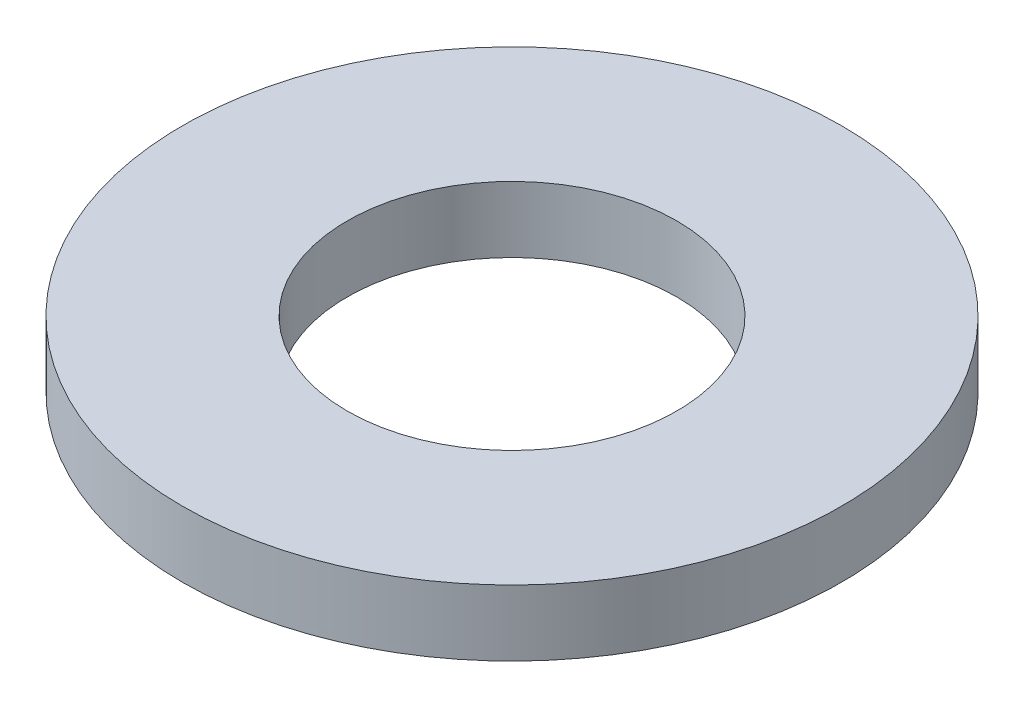
ISO-10303-21;
HEADER;
FILE_DESCRIPTION(('STEP AP214'),'2;1');
FILE_NAME('part.step','',(''),(''),'','','');
FILE_SCHEMA(('AUTOMOTIVE_DESIGN { 1 0 10303 214 1 1 1 1 }'));
ENDSEC;
DATA;
#1=APPLICATION_CONTEXT('core data for automotive mechanical design processes');
#2=APPLICATION_PROTOCOL_DEFINITION('international standard','automotive_design',2000,#1);
#3=PRODUCT_CONTEXT('',#1,'mechanical');
#4=PRODUCT('Part','Part','',(#3));
#5=PRODUCT_RELATED_PRODUCT_CATEGORY('part','',(#4));
#6=PRODUCT_DEFINITION_FORMATION('','',#4);
#7=PRODUCT_DEFINITION_CONTEXT('part definition',#1,'design');
#8=PRODUCT_DEFINITION('design','',#6,#7);
#9=PRODUCT_DEFINITION_SHAPE('','',#8);
#10=(LENGTH_UNIT() NAMED_UNIT(*) SI_UNIT(.MILLI.,.METRE.));
#11=(NAMED_UNIT(*) PLANE_ANGLE_UNIT() SI_UNIT($,.RADIAN.));
#12=(NAMED_UNIT(*) SI_UNIT($,.STERADIAN.) SOLID_ANGLE_UNIT());
#13=UNCERTAINTY_MEASURE_WITH_UNIT(LENGTH_MEASURE(1.E-05),#10,'distance_accuracy_value','');
#14=(GEOMETRIC_REPRESENTATION_CONTEXT(3) GLOBAL_UNCERTAINTY_ASSIGNED_CONTEXT((#13)) GLOBAL_UNIT_ASSIGNED_CONTEXT((#10,
#11,#12)) REPRESENTATION_CONTEXT('',''));
#15=CARTESIAN_POINT('',(0.,0.,0.));
#16=DIRECTION('',(0.,0.,1.));
#17=DIRECTION('',(1.,0.,0.));
#18=AXIS2_PLACEMENT_3D('',#15,#16,#17);
#19=CARTESIAN_POINT('',(0.,15.,0.));
#20=DIRECTION('',(0.,-1.,0.));
#21=DIRECTION('',(0.,0.,-1.));
#22=AXIS2_PLACEMENT_3D('',#19,#20,#21);
#23=CYLINDRICAL_SURFACE('',#22,75.);
#24=CARTESIAN_POINT('',(0.,15.,0.));
#25=DIRECTION('',(0.,1.,0.));
#26=DIRECTION('',(0.,0.,1.));
#27=AXIS2_PLACEMENT_3D('',#24,#25,#26);
#28=CIRCLE('',#27,75.);
#29=CARTESIAN_POINT('',(0.,15.,75.));
#30=VERTEX_POINT('',#29);
#31=EDGE_CURVE('E10',#30,#30,#28,.T.);
#32=ORIENTED_EDGE('',*,*,#31,.F.);
#33=EDGE_LOOP('',(#32));
#34=FACE_BOUND('',#33,.T.);
#35=CARTESIAN_POINT('',(0.,0.,0.));
#36=DIRECTION('',(0.,1.,0.));
#37=DIRECTION('',(0.,0.,1.));
#38=AXIS2_PLACEMENT_3D('',#35,#36,#37);
#39=CIRCLE('',#38,75.);
#40=CARTESIAN_POINT('',(0.,0.,75.));
#41=VERTEX_POINT('',#40);
#42=EDGE_CURVE('E37',#41,#41,#39,.T.);
#43=ORIENTED_EDGE('',*,*,#42,.T.);
#44=EDGE_LOOP('',(#43));
#45=FACE_BOUND('',#44,.T.);
#46=ADVANCED_FACE('F40',(#34,#45),#23,.T.);
#47=CARTESIAN_POINT('',(0.,15.,0.));
#48=DIRECTION('',(0.,1.,0.));
#49=DIRECTION('',(0.,0.,1.));
#50=AXIS2_PLACEMENT_3D('',#47,#48,#49);
#51=PLANE('',#50);
#52=CARTESIAN_POINT('',(0.,15.,0.));
#53=DIRECTION('',(0.,1.,0.));
#54=DIRECTION('',(0.,0.,1.));
#55=AXIS2_PLACEMENT_3D('',#52,#53,#54);
#56=CIRCLE('',#55,37.5);
#57=CARTESIAN_POINT('',(0.,15.,37.5));
#58=VERTEX_POINT('',#57);
#59=EDGE_CURVE('E50',#58,#58,#56,.T.);
#60=ORIENTED_EDGE('',*,*,#59,.F.);
#61=EDGE_LOOP('',(#60));
#62=FACE_BOUND('',#61,.T.);
#63=ORIENTED_EDGE('',*,*,#31,.T.);
#64=EDGE_LOOP('',(#63));
#65=FACE_BOUND('',#64,.T.);
#66=ADVANCED_FACE('F59',(#62,#65),#51,.T.);
#67=CARTESIAN_POINT('',(0.,0.,0.));
#68=DIRECTION('',(0.,1.,0.));
#69=DIRECTION('',(0.,0.,1.));
#70=AXIS2_PLACEMENT_3D('',#67,#68,#69);
#71=PLANE('',#70);
#72=CARTESIAN_POINT('',(0.,0.,0.));
#73=DIRECTION('',(0.,1.,0.));
#74=DIRECTION('',(0.,0.,1.));
#75=AXIS2_PLACEMENT_3D('',#72,#73,#74);
#76=CIRCLE('',#75,37.5);
#77=CARTESIAN_POINT('',(0.,0.,37.5));
#78=VERTEX_POINT('',#77);
#79=EDGE_CURVE('E47',#78,#78,#76,.T.);
#80=ORIENTED_EDGE('',*,*,#79,.T.);
#81=EDGE_LOOP('',(#80));
#82=FACE_BOUND('',#81,.T.);
#83=ORIENTED_EDGE('',*,*,#42,.F.);
#84=EDGE_LOOP('',(#83));
#85=FACE_BOUND('',#84,.T.);
#86=ADVANCED_FACE('F58',(#82,#85),#71,.F.);
#87=CARTESIAN_POINT('',(0.,15.,0.));
#88=DIRECTION('',(0.,-1.,0.));
#89=DIRECTION('',(0.,0.,-1.));
#90=AXIS2_PLACEMENT_3D('',#87,#88,#89);
#91=CYLINDRICAL_SURFACE('',#90,37.5);
#92=ORIENTED_EDGE('',*,*,#59,.T.);
#93=EDGE_LOOP('',(#92));
#94=FACE_BOUND('',#93,.T.);
#95=ORIENTED_EDGE('',*,*,#79,.F.);
#96=EDGE_LOOP('',(#95));
#97=FACE_BOUND('',#96,.T.);
#98=ADVANCED_FACE('F54',(#94,#97),#91,.F.);
#99=CLOSED_SHELL('',(#46,#66,#86,#98));
#100=MANIFOLD_SOLID_BREP('B2',#99);
#101=ADVANCED_BREP_SHAPE_REPRESENTATION('',(#18,#100),#14);
#102=SHAPE_DEFINITION_REPRESENTATION(#9,#101);
ENDSEC;
END-ISO-10303-21;
